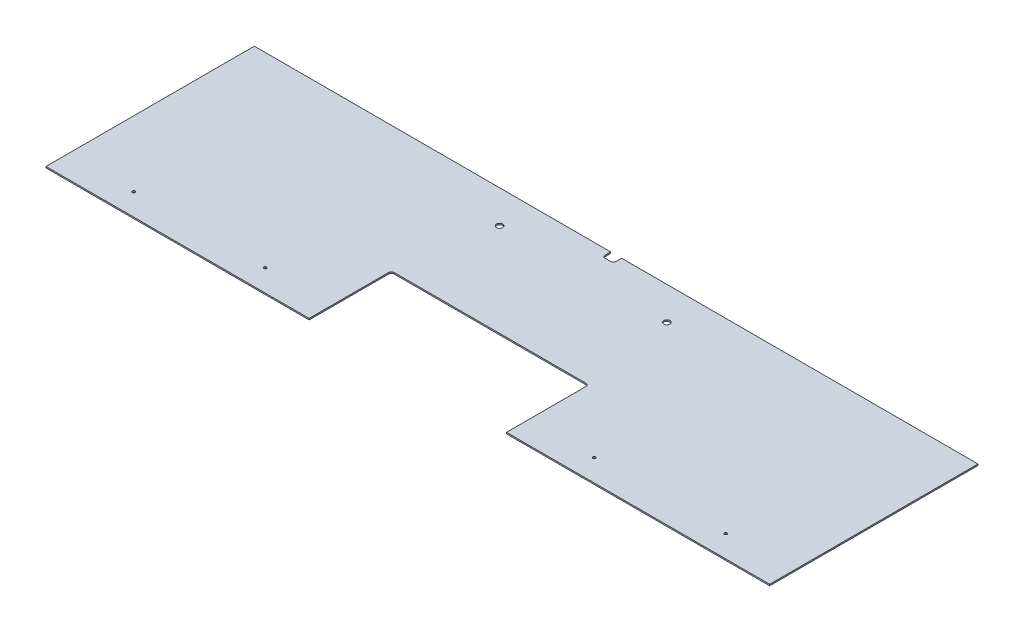
ISO-10303-21;
HEADER;
FILE_DESCRIPTION(('STEP AP214'),'2;1');
FILE_NAME('part.step','',(''),(''),'','','');
FILE_SCHEMA(('AUTOMOTIVE_DESIGN { 1 0 10303 214 1 1 1 1 }'));
ENDSEC;
DATA;
#1=APPLICATION_CONTEXT('core data for automotive mechanical design processes');
#2=APPLICATION_PROTOCOL_DEFINITION('international standard','automotive_design',2000,#1);
#3=PRODUCT_CONTEXT('',#1,'mechanical');
#4=PRODUCT('Part','Part','',(#3));
#5=PRODUCT_RELATED_PRODUCT_CATEGORY('part','',(#4));
#6=PRODUCT_DEFINITION_FORMATION('','',#4);
#7=PRODUCT_DEFINITION_CONTEXT('part definition',#1,'design');
#8=PRODUCT_DEFINITION('design','',#6,#7);
#9=PRODUCT_DEFINITION_SHAPE('','',#8);
#10=(LENGTH_UNIT() NAMED_UNIT(*) SI_UNIT(.MILLI.,.METRE.));
#11=(NAMED_UNIT(*) PLANE_ANGLE_UNIT() SI_UNIT($,.RADIAN.));
#12=(NAMED_UNIT(*) SI_UNIT($,.STERADIAN.) SOLID_ANGLE_UNIT());
#13=UNCERTAINTY_MEASURE_WITH_UNIT(LENGTH_MEASURE(1.E-05),#10,'distance_accuracy_value','');
#14=(GEOMETRIC_REPRESENTATION_CONTEXT(3) GLOBAL_UNCERTAINTY_ASSIGNED_CONTEXT((#13)) GLOBAL_UNIT_ASSIGNED_CONTEXT((#10,
#11,#12)) REPRESENTATION_CONTEXT('',''));
#15=CARTESIAN_POINT('',(0.,0.,0.));
#16=DIRECTION('',(0.,0.,1.));
#17=DIRECTION('',(1.,0.,0.));
#18=AXIS2_PLACEMENT_3D('',#15,#16,#17);
#19=CARTESIAN_POINT('',(2327.96027965546,0.,241.3));
#20=DIRECTION('',(0.,-1.,0.));
#21=DIRECTION('',(0.,0.,-1.));
#22=AXIS2_PLACEMENT_3D('',#19,#20,#21);
#23=PLANE('',#22);
#24=CARTESIAN_POINT('',(2334.31027965546,0.,12.7));
#25=DIRECTION('',(0.,1.,0.));
#26=DIRECTION('',(0.,0.,1.));
#27=AXIS2_PLACEMENT_3D('',#24,#25,#26);
#28=CIRCLE('',#27,6.35);
#29=CARTESIAN_POINT('',(2340.66027965545,0.,12.7));
#30=VERTEX_POINT('',#29);
#31=CARTESIAN_POINT('',(2334.31027965546,0.,19.05));
#32=VERTEX_POINT('',#31);
#33=EDGE_CURVE('E152',#30,#32,#28,.F.);
#34=ORIENTED_EDGE('',*,*,#33,.T.);
#35=DIRECTION('',(-1.,0.,0.));
#36=VECTOR('',#35,1.);
#37=CARTESIAN_POINT('',(2327.96027965546,0.,19.05));
#38=LINE('',#37,#36);
#39=CARTESIAN_POINT('',(2321.61027965545,0.,19.05));
#40=VERTEX_POINT('',#39);
#41=EDGE_CURVE('E155',#40,#32,#38,.F.);
#42=ORIENTED_EDGE('',*,*,#41,.F.);
#43=CARTESIAN_POINT('',(2321.61027965545,0.,12.7));
#44=DIRECTION('',(0.,1.,0.));
#45=DIRECTION('',(0.,0.,1.));
#46=AXIS2_PLACEMENT_3D('',#43,#44,#45);
#47=CIRCLE('',#46,6.35);
#48=CARTESIAN_POINT('',(2315.26027965546,0.,12.7));
#49=VERTEX_POINT('',#48);
#50=EDGE_CURVE('E161',#40,#49,#47,.F.);
#51=ORIENTED_EDGE('',*,*,#50,.T.);
#52=DIRECTION('',(0.,0.,-1.));
#53=VECTOR('',#52,1.);
#54=CARTESIAN_POINT('',(2315.26027965546,0.,9.525));
#55=LINE('',#54,#53);
#56=CARTESIAN_POINT('',(2315.26027965546,0.,0.));
#57=VERTEX_POINT('',#56);
#58=EDGE_CURVE('E165',#57,#49,#55,.F.);
#59=ORIENTED_EDGE('',*,*,#58,.F.);
#60=DIRECTION('',(1.,0.,0.));
#61=VECTOR('',#60,1.);
#62=CARTESIAN_POINT('',(1902.51027965545,0.,0.));
#63=LINE('',#62,#61);
#64=CARTESIAN_POINT('',(1489.76027965546,0.,0.));
#65=VERTEX_POINT('',#64);
#66=EDGE_CURVE('E178',#57,#65,#63,.F.);
#67=ORIENTED_EDGE('',*,*,#66,.T.);
#68=DIRECTION('',(0.,0.,-1.));
#69=VECTOR('',#68,1.);
#70=CARTESIAN_POINT('',(1489.76027965546,0.,241.3));
#71=LINE('',#70,#69);
#72=CARTESIAN_POINT('',(1489.76027965546,0.,482.6));
#73=VERTEX_POINT('',#72);
#74=EDGE_CURVE('E179',#65,#73,#71,.F.);
#75=ORIENTED_EDGE('',*,*,#74,.T.);
#76=DIRECTION('',(1.,0.,0.));
#77=VECTOR('',#76,1.);
#78=CARTESIAN_POINT('',(1794.56027965545,0.,482.6));
#79=LINE('',#78,#77);
#80=CARTESIAN_POINT('',(2099.36027965545,0.,482.6));
#81=VERTEX_POINT('',#80);
#82=EDGE_CURVE('E200',#81,#73,#79,.F.);
#83=ORIENTED_EDGE('',*,*,#82,.F.);
#84=DIRECTION('',(0.,0.,1.));
#85=VECTOR('',#84,1.);
#86=CARTESIAN_POINT('',(2099.36027965545,0.,387.35));
#87=LINE('',#86,#85);
#88=CARTESIAN_POINT('',(2099.36027965545,0.,298.45));
#89=VERTEX_POINT('',#88);
#90=EDGE_CURVE('E205',#81,#89,#87,.F.);
#91=ORIENTED_EDGE('',*,*,#90,.T.);
#92=CARTESIAN_POINT('',(2105.71027965545,0.,298.45));
#93=DIRECTION('',(0.,1.,0.));
#94=DIRECTION('',(0.,0.,1.));
#95=AXIS2_PLACEMENT_3D('',#92,#93,#94);
#96=CIRCLE('',#95,6.35);
#97=CARTESIAN_POINT('',(2105.71027965545,0.,292.1));
#98=VERTEX_POINT('',#97);
#99=EDGE_CURVE('E208',#89,#98,#96,.F.);
#100=ORIENTED_EDGE('',*,*,#99,.T.);
#101=DIRECTION('',(-1.,0.,0.));
#102=VECTOR('',#101,1.);
#103=CARTESIAN_POINT('',(2327.96027965546,0.,292.1));
#104=LINE('',#103,#102);
#105=CARTESIAN_POINT('',(2550.21027965546,0.,292.1));
#106=VERTEX_POINT('',#105);
#107=EDGE_CURVE('E86',#98,#106,#104,.F.);
#108=ORIENTED_EDGE('',*,*,#107,.T.);
#109=CARTESIAN_POINT('',(2550.21027965546,0.,298.45));
#110=DIRECTION('',(0.,-1.,0.));
#111=DIRECTION('',(0.,0.,-1.));
#112=AXIS2_PLACEMENT_3D('',#109,#110,#111);
#113=CIRCLE('',#112,6.35);
#114=CARTESIAN_POINT('',(2556.56027965545,0.,298.45));
#115=VERTEX_POINT('',#114);
#116=EDGE_CURVE('E90',#106,#115,#113,.T.);
#117=ORIENTED_EDGE('',*,*,#116,.T.);
#118=DIRECTION('',(0.,0.,1.));
#119=VECTOR('',#118,1.);
#120=CARTESIAN_POINT('',(2556.56027965545,0.,387.35));
#121=LINE('',#120,#119);
#122=CARTESIAN_POINT('',(2556.56027965545,0.,482.6));
#123=VERTEX_POINT('',#122);
#124=EDGE_CURVE('E95',#123,#115,#121,.F.);
#125=ORIENTED_EDGE('',*,*,#124,.F.);
#126=DIRECTION('',(-1.,0.,0.));
#127=VECTOR('',#126,1.);
#128=CARTESIAN_POINT('',(2861.36027965546,0.,482.6));
#129=LINE('',#128,#127);
#130=CARTESIAN_POINT('',(3166.16027965546,0.,482.6));
#131=VERTEX_POINT('',#130);
#132=EDGE_CURVE('E226',#123,#131,#129,.F.);
#133=ORIENTED_EDGE('',*,*,#132,.T.);
#134=DIRECTION('',(0.,0.,1.));
#135=VECTOR('',#134,1.);
#136=CARTESIAN_POINT('',(3166.16027965546,0.,241.3));
#137=LINE('',#136,#135);
#138=CARTESIAN_POINT('',(3166.16027965546,0.,0.));
#139=VERTEX_POINT('',#138);
#140=EDGE_CURVE('E227',#131,#139,#137,.F.);
#141=ORIENTED_EDGE('',*,*,#140,.T.);
#142=DIRECTION('',(1.,0.,0.));
#143=VECTOR('',#142,1.);
#144=CARTESIAN_POINT('',(2753.41027965545,0.,0.));
#145=LINE('',#144,#143);
#146=CARTESIAN_POINT('',(2340.66027965545,0.,0.));
#147=VERTEX_POINT('',#146);
#148=EDGE_CURVE('E124',#139,#147,#145,.F.);
#149=ORIENTED_EDGE('',*,*,#148,.T.);
#150=DIRECTION('',(0.,0.,1.));
#151=VECTOR('',#150,1.);
#152=CARTESIAN_POINT('',(2340.66027965545,0.,9.525));
#153=LINE('',#152,#151);
#154=EDGE_CURVE('E121',#30,#147,#153,.F.);
#155=ORIENTED_EDGE('',*,*,#154,.F.);
#156=EDGE_LOOP('',(#34,#42,#51,#59,#67,#75,#83,#91,#100,#108,#117,#125,#133,#141,#149,#155));
#157=FACE_BOUND('',#156,.T.);
#158=CARTESIAN_POINT('',(2134.28527965546,0.,76.2));
#159=DIRECTION('',(0.,-1.,0.));
#160=DIRECTION('',(0.,0.,-1.));
#161=AXIS2_PLACEMENT_3D('',#158,#159,#160);
#162=CIRCLE('',#161,7.14375);
#163=CARTESIAN_POINT('',(2134.28527965546,0.,69.05625));
#164=VERTEX_POINT('',#163);
#165=EDGE_CURVE('E242',#164,#164,#162,.T.);
#166=ORIENTED_EDGE('',*,*,#165,.T.);
#167=EDGE_LOOP('',(#166));
#168=FACE_BOUND('',#167,.T.);
#169=CARTESIAN_POINT('',(2521.63527965546,0.,76.2));
#170=DIRECTION('',(0.,-1.,0.));
#171=DIRECTION('',(0.,0.,-1.));
#172=AXIS2_PLACEMENT_3D('',#169,#170,#171);
#173=CIRCLE('',#172,7.14375);
#174=CARTESIAN_POINT('',(2521.63527965546,0.,69.05625));
#175=VERTEX_POINT('',#174);
#176=EDGE_CURVE('E307',#175,#175,#173,.T.);
#177=ORIENTED_EDGE('',*,*,#176,.T.);
#178=EDGE_LOOP('',(#177));
#179=FACE_BOUND('',#178,.T.);
#180=CARTESIAN_POINT('',(1642.16027965546,0.,431.8));
#181=DIRECTION('',(0.,1.,0.));
#182=DIRECTION('',(0.,0.,1.));
#183=AXIS2_PLACEMENT_3D('',#180,#181,#182);
#184=CIRCLE('',#183,3.175);
#185=CARTESIAN_POINT('',(1642.16027965546,0.,434.975));
#186=VERTEX_POINT('',#185);
#187=EDGE_CURVE('E310',#186,#186,#184,.F.);
#188=ORIENTED_EDGE('',*,*,#187,.T.);
#189=EDGE_LOOP('',(#188));
#190=FACE_BOUND('',#189,.T.);
#191=CARTESIAN_POINT('',(1946.96027965546,0.,431.8));
#192=DIRECTION('',(0.,1.,0.));
#193=DIRECTION('',(0.,0.,1.));
#194=AXIS2_PLACEMENT_3D('',#191,#192,#193);
#195=CIRCLE('',#194,3.175);
#196=CARTESIAN_POINT('',(1946.96027965546,0.,434.975));
#197=VERTEX_POINT('',#196);
#198=EDGE_CURVE('E313',#197,#197,#195,.F.);
#199=ORIENTED_EDGE('',*,*,#198,.T.);
#200=EDGE_LOOP('',(#199));
#201=FACE_BOUND('',#200,.T.);
#202=CARTESIAN_POINT('',(2708.96027965546,0.,431.8));
#203=DIRECTION('',(0.,1.,0.));
#204=DIRECTION('',(0.,0.,1.));
#205=AXIS2_PLACEMENT_3D('',#202,#203,#204);
#206=CIRCLE('',#205,3.175);
#207=CARTESIAN_POINT('',(2708.96027965546,0.,434.975));
#208=VERTEX_POINT('',#207);
#209=EDGE_CURVE('E315',#208,#208,#206,.F.);
#210=ORIENTED_EDGE('',*,*,#209,.T.);
#211=EDGE_LOOP('',(#210));
#212=FACE_BOUND('',#211,.T.);
#213=CARTESIAN_POINT('',(3013.76027965546,0.,431.8));
#214=DIRECTION('',(0.,1.,0.));
#215=DIRECTION('',(0.,0.,1.));
#216=AXIS2_PLACEMENT_3D('',#213,#214,#215);
#217=CIRCLE('',#216,3.175);
#218=CARTESIAN_POINT('',(3013.76027965546,0.,434.975));
#219=VERTEX_POINT('',#218);
#220=EDGE_CURVE('E17',#219,#219,#217,.F.);
#221=ORIENTED_EDGE('',*,*,#220,.T.);
#222=EDGE_LOOP('',(#221));
#223=FACE_BOUND('',#222,.T.);
#224=ADVANCED_FACE('F14',(#157,#168,#179,#190,#201,#212,#223),#23,.F.);
#225=CARTESIAN_POINT('',(3013.76027965546,1742.26440662134,431.8));
#226=DIRECTION('',(0.,1.,0.));
#227=DIRECTION('',(0.,0.,1.));
#228=AXIS2_PLACEMENT_3D('',#225,#226,#227);
#229=CYLINDRICAL_SURFACE('',#228,3.175);
#230=ORIENTED_EDGE('',*,*,#220,.F.);
#231=EDGE_LOOP('',(#230));
#232=FACE_BOUND('',#231,.T.);
#233=CARTESIAN_POINT('',(3013.76027965546,-3.17499999999993,431.8));
#234=DIRECTION('',(0.,1.,0.));
#235=DIRECTION('',(0.,0.,1.));
#236=AXIS2_PLACEMENT_3D('',#233,#234,#235);
#237=CIRCLE('',#236,3.175);
#238=CARTESIAN_POINT('',(3013.76027965546,-3.17499999999993,434.975));
#239=VERTEX_POINT('',#238);
#240=EDGE_CURVE('E151',#239,#239,#237,.T.);
#241=ORIENTED_EDGE('',*,*,#240,.F.);
#242=EDGE_LOOP('',(#241));
#243=FACE_BOUND('',#242,.T.);
#244=ADVANCED_FACE('F323',(#232,#243),#229,.F.);
#245=CARTESIAN_POINT('',(2708.96027965546,1742.26440662134,431.8));
#246=DIRECTION('',(0.,1.,0.));
#247=DIRECTION('',(0.,0.,1.));
#248=AXIS2_PLACEMENT_3D('',#245,#246,#247);
#249=CYLINDRICAL_SURFACE('',#248,3.175);
#250=ORIENTED_EDGE('',*,*,#209,.F.);
#251=EDGE_LOOP('',(#250));
#252=FACE_BOUND('',#251,.T.);
#253=CARTESIAN_POINT('',(2708.96027965546,-3.17499999999993,431.8));
#254=DIRECTION('',(0.,1.,0.));
#255=DIRECTION('',(0.,0.,1.));
#256=AXIS2_PLACEMENT_3D('',#253,#254,#255);
#257=CIRCLE('',#256,3.175);
#258=CARTESIAN_POINT('',(2708.96027965546,-3.17499999999993,434.975));
#259=VERTEX_POINT('',#258);
#260=EDGE_CURVE('E296',#259,#259,#257,.T.);
#261=ORIENTED_EDGE('',*,*,#260,.F.);
#262=EDGE_LOOP('',(#261));
#263=FACE_BOUND('',#262,.T.);
#264=ADVANCED_FACE('F326',(#252,#263),#249,.F.);
#265=CARTESIAN_POINT('',(1946.96027965546,1742.26440662134,431.8));
#266=DIRECTION('',(0.,1.,0.));
#267=DIRECTION('',(0.,0.,1.));
#268=AXIS2_PLACEMENT_3D('',#265,#266,#267);
#269=CYLINDRICAL_SURFACE('',#268,3.175);
#270=ORIENTED_EDGE('',*,*,#198,.F.);
#271=EDGE_LOOP('',(#270));
#272=FACE_BOUND('',#271,.T.);
#273=CARTESIAN_POINT('',(1946.96027965546,-3.17499999999993,431.8));
#274=DIRECTION('',(0.,1.,0.));
#275=DIRECTION('',(0.,0.,1.));
#276=AXIS2_PLACEMENT_3D('',#273,#274,#275);
#277=CIRCLE('',#276,3.175);
#278=CARTESIAN_POINT('',(1946.96027965546,-3.17499999999993,434.975));
#279=VERTEX_POINT('',#278);
#280=EDGE_CURVE('E293',#279,#279,#277,.T.);
#281=ORIENTED_EDGE('',*,*,#280,.F.);
#282=EDGE_LOOP('',(#281));
#283=FACE_BOUND('',#282,.T.);
#284=ADVANCED_FACE('F405',(#272,#283),#269,.F.);
#285=CARTESIAN_POINT('',(1642.16027965546,1742.26440662134,431.8));
#286=DIRECTION('',(0.,1.,0.));
#287=DIRECTION('',(0.,0.,1.));
#288=AXIS2_PLACEMENT_3D('',#285,#286,#287);
#289=CYLINDRICAL_SURFACE('',#288,3.175);
#290=ORIENTED_EDGE('',*,*,#187,.F.);
#291=EDGE_LOOP('',(#290));
#292=FACE_BOUND('',#291,.T.);
#293=CARTESIAN_POINT('',(1642.16027965546,-3.17499999999993,431.8));
#294=DIRECTION('',(0.,1.,0.));
#295=DIRECTION('',(0.,0.,1.));
#296=AXIS2_PLACEMENT_3D('',#293,#294,#295);
#297=CIRCLE('',#296,3.175);
#298=CARTESIAN_POINT('',(1642.16027965546,-3.17499999999993,434.975));
#299=VERTEX_POINT('',#298);
#300=EDGE_CURVE('E290',#299,#299,#297,.T.);
#301=ORIENTED_EDGE('',*,*,#300,.F.);
#302=EDGE_LOOP('',(#301));
#303=FACE_BOUND('',#302,.T.);
#304=ADVANCED_FACE('F401',(#292,#303),#289,.F.);
#305=CARTESIAN_POINT('',(2521.63527965546,-1746.63173941221,76.2));
#306=DIRECTION('',(0.,-1.,0.));
#307=DIRECTION('',(0.,0.,-1.));
#308=AXIS2_PLACEMENT_3D('',#305,#306,#307);
#309=CYLINDRICAL_SURFACE('',#308,7.14375);
#310=ORIENTED_EDGE('',*,*,#176,.F.);
#311=EDGE_LOOP('',(#310));
#312=FACE_BOUND('',#311,.T.);
#313=CARTESIAN_POINT('',(2521.63527965546,-3.17499999999993,76.2));
#314=DIRECTION('',(0.,-1.,0.));
#315=DIRECTION('',(0.,0.,-1.));
#316=AXIS2_PLACEMENT_3D('',#313,#314,#315);
#317=CIRCLE('',#316,7.14375);
#318=CARTESIAN_POINT('',(2521.63527965546,-3.17499999999993,69.05625));
#319=VERTEX_POINT('',#318);
#320=EDGE_CURVE('E142',#319,#319,#317,.F.);
#321=ORIENTED_EDGE('',*,*,#320,.F.);
#322=EDGE_LOOP('',(#321));
#323=FACE_BOUND('',#322,.T.);
#324=ADVANCED_FACE('F397',(#312,#323),#309,.F.);
#325=CARTESIAN_POINT('',(2134.28527965546,-1746.63173941221,76.2));
#326=DIRECTION('',(0.,-1.,0.));
#327=DIRECTION('',(0.,0.,-1.));
#328=AXIS2_PLACEMENT_3D('',#325,#326,#327);
#329=CYLINDRICAL_SURFACE('',#328,7.14375);
#330=ORIENTED_EDGE('',*,*,#165,.F.);
#331=EDGE_LOOP('',(#330));
#332=FACE_BOUND('',#331,.T.);
#333=CARTESIAN_POINT('',(2134.28527965546,-3.17499999999993,76.2));
#334=DIRECTION('',(0.,-1.,0.));
#335=DIRECTION('',(0.,0.,-1.));
#336=AXIS2_PLACEMENT_3D('',#333,#334,#335);
#337=CIRCLE('',#336,7.14375);
#338=CARTESIAN_POINT('',(2134.28527965546,-3.17499999999993,69.05625));
#339=VERTEX_POINT('',#338);
#340=EDGE_CURVE('E139',#339,#339,#337,.F.);
#341=ORIENTED_EDGE('',*,*,#340,.F.);
#342=EDGE_LOOP('',(#341));
#343=FACE_BOUND('',#342,.T.);
#344=ADVANCED_FACE('F394',(#332,#343),#329,.F.);
#345=CARTESIAN_POINT('',(2340.66027965545,-3.175,9.525));
#346=DIRECTION('',(-1.,0.,0.));
#347=DIRECTION('',(0.,0.,1.));
#348=AXIS2_PLACEMENT_3D('',#345,#346,#347);
#349=PLANE('',#348);
#350=ORIENTED_EDGE('',*,*,#154,.T.);
#351=DIRECTION('',(0.,1.,0.));
#352=VECTOR('',#351,1.);
#353=CARTESIAN_POINT('',(2340.66027965545,-3.175,0.));
#354=LINE('',#353,#352);
#355=CARTESIAN_POINT('',(2340.66027965545,-3.175,0.));
#356=VERTEX_POINT('',#355);
#357=EDGE_CURVE('E114',#147,#356,#354,.F.);
#358=ORIENTED_EDGE('',*,*,#357,.T.);
#359=DIRECTION('',(0.,0.,-1.));
#360=VECTOR('',#359,1.);
#361=CARTESIAN_POINT('',(2340.66027965545,-3.175,241.3));
#362=LINE('',#361,#360);
#363=CARTESIAN_POINT('',(2340.66027965545,-3.175,12.7));
#364=VERTEX_POINT('',#363);
#365=EDGE_CURVE('E119',#364,#356,#362,.T.);
#366=ORIENTED_EDGE('',*,*,#365,.F.);
#367=DIRECTION('',(0.,1.,0.));
#368=VECTOR('',#367,1.);
#369=CARTESIAN_POINT('',(2340.66027965546,-3.175,12.7));
#370=LINE('',#369,#368);
#371=EDGE_CURVE('E153',#364,#30,#370,.T.);
#372=ORIENTED_EDGE('',*,*,#371,.T.);
#373=EDGE_LOOP('',(#350,#358,#366,#372));
#374=FACE_BOUND('',#373,.T.);
#375=ADVANCED_FACE('F116',(#374),#349,.T.);
#376=CARTESIAN_POINT('',(2753.41027965545,-3.175,0.));
#377=DIRECTION('',(0.,0.,1.));
#378=DIRECTION('',(1.,0.,0.));
#379=AXIS2_PLACEMENT_3D('',#376,#377,#378);
#380=PLANE('',#379);
#381=DIRECTION('',(0.,1.,0.));
#382=VECTOR('',#381,1.);
#383=CARTESIAN_POINT('',(3166.16027965546,-3.175,0.));
#384=LINE('',#383,#382);
#385=CARTESIAN_POINT('',(3166.16027965546,-3.175,0.));
#386=VERTEX_POINT('',#385);
#387=EDGE_CURVE('E130',#139,#386,#384,.F.);
#388=ORIENTED_EDGE('',*,*,#387,.T.);
#389=DIRECTION('',(1.,0.,0.));
#390=VECTOR('',#389,1.);
#391=CARTESIAN_POINT('',(2327.96027965546,-3.175,0.));
#392=LINE('',#391,#390);
#393=EDGE_CURVE('E127',#356,#386,#392,.T.);
#394=ORIENTED_EDGE('',*,*,#393,.F.);
#395=ORIENTED_EDGE('',*,*,#357,.F.);
#396=ORIENTED_EDGE('',*,*,#148,.F.);
#397=EDGE_LOOP('',(#388,#394,#395,#396));
#398=FACE_BOUND('',#397,.T.);
#399=ADVANCED_FACE('F128',(#398),#380,.F.);
#400=CARTESIAN_POINT('',(3166.16027965546,-3.175,241.3));
#401=DIRECTION('',(-1.,0.,0.));
#402=DIRECTION('',(0.,0.,1.));
#403=AXIS2_PLACEMENT_3D('',#400,#401,#402);
#404=PLANE('',#403);
#405=DIRECTION('',(0.,1.,0.));
#406=VECTOR('',#405,1.);
#407=CARTESIAN_POINT('',(3166.16027965546,-3.175,482.6));
#408=LINE('',#407,#406);
#409=CARTESIAN_POINT('',(3166.16027965546,-3.175,482.6));
#410=VERTEX_POINT('',#409);
#411=EDGE_CURVE('E224',#131,#410,#408,.F.);
#412=ORIENTED_EDGE('',*,*,#411,.T.);
#413=DIRECTION('',(0.,0.,-1.));
#414=VECTOR('',#413,1.);
#415=CARTESIAN_POINT('',(3166.16027965546,-3.175,241.3));
#416=LINE('',#415,#414);
#417=EDGE_CURVE('E134',#386,#410,#416,.F.);
#418=ORIENTED_EDGE('',*,*,#417,.F.);
#419=ORIENTED_EDGE('',*,*,#387,.F.);
#420=ORIENTED_EDGE('',*,*,#140,.F.);
#421=EDGE_LOOP('',(#412,#418,#419,#420));
#422=FACE_BOUND('',#421,.T.);
#423=ADVANCED_FACE('F385',(#422),#404,.F.);
#424=CARTESIAN_POINT('',(2861.36027965546,-3.175,482.6));
#425=DIRECTION('',(0.,0.,-1.));
#426=DIRECTION('',(-1.,0.,0.));
#427=AXIS2_PLACEMENT_3D('',#424,#425,#426);
#428=PLANE('',#427);
#429=DIRECTION('',(0.,1.,0.));
#430=VECTOR('',#429,1.);
#431=CARTESIAN_POINT('',(2556.56027965545,-3.175,482.6));
#432=LINE('',#431,#430);
#433=CARTESIAN_POINT('',(2556.56027965545,-3.175,482.6));
#434=VERTEX_POINT('',#433);
#435=EDGE_CURVE('E213',#434,#123,#432,.T.);
#436=ORIENTED_EDGE('',*,*,#435,.F.);
#437=DIRECTION('',(1.,0.,0.));
#438=VECTOR('',#437,1.);
#439=CARTESIAN_POINT('',(2327.96027965546,-3.175,482.6));
#440=LINE('',#439,#438);
#441=EDGE_CURVE('E218',#410,#434,#440,.F.);
#442=ORIENTED_EDGE('',*,*,#441,.F.);
#443=ORIENTED_EDGE('',*,*,#411,.F.);
#444=ORIENTED_EDGE('',*,*,#132,.F.);
#445=EDGE_LOOP('',(#436,#442,#443,#444));
#446=FACE_BOUND('',#445,.T.);
#447=ADVANCED_FACE('F381',(#446),#428,.F.);
#448=CARTESIAN_POINT('',(2556.56027965545,-3.175,387.35));
#449=DIRECTION('',(-1.,0.,0.));
#450=DIRECTION('',(0.,0.,1.));
#451=AXIS2_PLACEMENT_3D('',#448,#449,#450);
#452=PLANE('',#451);
#453=DIRECTION('',(0.,0.,-1.));
#454=VECTOR('',#453,1.);
#455=CARTESIAN_POINT('',(2556.56027965545,-3.175,241.3));
#456=LINE('',#455,#454);
#457=CARTESIAN_POINT('',(2556.56027965545,-3.175,298.45));
#458=VERTEX_POINT('',#457);
#459=EDGE_CURVE('E221',#434,#458,#456,.T.);
#460=ORIENTED_EDGE('',*,*,#459,.F.);
#461=ORIENTED_EDGE('',*,*,#435,.T.);
#462=ORIENTED_EDGE('',*,*,#124,.T.);
#463=DIRECTION('',(0.,-1.,0.));
#464=VECTOR('',#463,1.);
#465=CARTESIAN_POINT('',(2556.56027965546,-3.175,298.45));
#466=LINE('',#465,#464);
#467=EDGE_CURVE('E211',#115,#458,#466,.T.);
#468=ORIENTED_EDGE('',*,*,#467,.T.);
#469=EDGE_LOOP('',(#460,#461,#462,#468));
#470=FACE_BOUND('',#469,.T.);
#471=ADVANCED_FACE('F377',(#470),#452,.T.);
#472=CARTESIAN_POINT('',(2550.21027965546,-3.175,298.45));
#473=DIRECTION('',(0.,-1.,0.));
#474=DIRECTION('',(0.,0.,-1.));
#475=AXIS2_PLACEMENT_3D('',#472,#473,#474);
#476=CYLINDRICAL_SURFACE('',#475,6.35);
#477=ORIENTED_EDGE('',*,*,#467,.F.);
#478=ORIENTED_EDGE('',*,*,#116,.F.);
#479=DIRECTION('',(0.,1.,0.));
#480=VECTOR('',#479,1.);
#481=CARTESIAN_POINT('',(2550.21027965546,-3.175,292.1));
#482=LINE('',#481,#480);
#483=CARTESIAN_POINT('',(2550.21027965546,-3.175,292.1));
#484=VERTEX_POINT('',#483);
#485=EDGE_CURVE('E209',#106,#484,#482,.F.);
#486=ORIENTED_EDGE('',*,*,#485,.T.);
#487=CARTESIAN_POINT('',(2550.21027965546,-3.175,298.45));
#488=DIRECTION('',(0.,-1.,0.));
#489=DIRECTION('',(0.,0.,-1.));
#490=AXIS2_PLACEMENT_3D('',#487,#488,#489);
#491=CIRCLE('',#490,6.35);
#492=EDGE_CURVE('E285',#458,#484,#491,.F.);
#493=ORIENTED_EDGE('',*,*,#492,.F.);
#494=EDGE_LOOP('',(#477,#478,#486,#493));
#495=FACE_BOUND('',#494,.T.);
#496=ADVANCED_FACE('F373',(#495),#476,.F.);
#497=CARTESIAN_POINT('',(2327.96027965546,-3.175,292.1));
#498=DIRECTION('',(0.,0.,-1.));
#499=DIRECTION('',(-1.,0.,0.));
#500=AXIS2_PLACEMENT_3D('',#497,#498,#499);
#501=PLANE('',#500);
#502=ORIENTED_EDGE('',*,*,#485,.F.);
#503=ORIENTED_EDGE('',*,*,#107,.F.);
#504=DIRECTION('',(0.,1.,0.));
#505=VECTOR('',#504,1.);
#506=CARTESIAN_POINT('',(2105.71027965545,-3.175,292.1));
#507=LINE('',#506,#505);
#508=CARTESIAN_POINT('',(2105.71027965545,-3.175,292.1));
#509=VERTEX_POINT('',#508);
#510=EDGE_CURVE('E206',#98,#509,#507,.F.);
#511=ORIENTED_EDGE('',*,*,#510,.T.);
#512=DIRECTION('',(1.,0.,0.));
#513=VECTOR('',#512,1.);
#514=CARTESIAN_POINT('',(2327.96027965546,-3.175,292.1));
#515=LINE('',#514,#513);
#516=EDGE_CURVE('E284',#484,#509,#515,.F.);
#517=ORIENTED_EDGE('',*,*,#516,.F.);
#518=EDGE_LOOP('',(#502,#503,#511,#517));
#519=FACE_BOUND('',#518,.T.);
#520=ADVANCED_FACE('F369',(#519),#501,.F.);
#521=CARTESIAN_POINT('',(2105.71027965545,-3.175,298.45));
#522=DIRECTION('',(0.,1.,0.));
#523=DIRECTION('',(0.,0.,1.));
#524=AXIS2_PLACEMENT_3D('',#521,#522,#523);
#525=CYLINDRICAL_SURFACE('',#524,6.35);
#526=ORIENTED_EDGE('',*,*,#510,.F.);
#527=ORIENTED_EDGE('',*,*,#99,.F.);
#528=DIRECTION('',(0.,1.,0.));
#529=VECTOR('',#528,1.);
#530=CARTESIAN_POINT('',(2099.36027965545,-3.175,298.45));
#531=LINE('',#530,#529);
#532=CARTESIAN_POINT('',(2099.36027965545,-3.175,298.45));
#533=VERTEX_POINT('',#532);
#534=EDGE_CURVE('E203',#89,#533,#531,.F.);
#535=ORIENTED_EDGE('',*,*,#534,.T.);
#536=CARTESIAN_POINT('',(2105.71027965545,-3.175,298.45));
#537=DIRECTION('',(0.,1.,0.));
#538=DIRECTION('',(0.,0.,1.));
#539=AXIS2_PLACEMENT_3D('',#536,#537,#538);
#540=CIRCLE('',#539,6.35);
#541=EDGE_CURVE('E281',#509,#533,#540,.T.);
#542=ORIENTED_EDGE('',*,*,#541,.F.);
#543=EDGE_LOOP('',(#526,#527,#535,#542));
#544=FACE_BOUND('',#543,.T.);
#545=ADVANCED_FACE('F365',(#544),#525,.F.);
#546=CARTESIAN_POINT('',(2099.36027965545,-3.175,387.35));
#547=DIRECTION('',(-1.,0.,0.));
#548=DIRECTION('',(0.,0.,1.));
#549=AXIS2_PLACEMENT_3D('',#546,#547,#548);
#550=PLANE('',#549);
#551=ORIENTED_EDGE('',*,*,#534,.F.);
#552=ORIENTED_EDGE('',*,*,#90,.F.);
#553=DIRECTION('',(0.,1.,0.));
#554=VECTOR('',#553,1.);
#555=CARTESIAN_POINT('',(2099.36027965545,-3.175,482.6));
#556=LINE('',#555,#554);
#557=CARTESIAN_POINT('',(2099.36027965545,-3.175,482.6));
#558=VERTEX_POINT('',#557);
#559=EDGE_CURVE('E190',#558,#81,#556,.T.);
#560=ORIENTED_EDGE('',*,*,#559,.F.);
#561=DIRECTION('',(0.,0.,-1.));
#562=VECTOR('',#561,1.);
#563=CARTESIAN_POINT('',(2099.36027965545,-3.175,241.3));
#564=LINE('',#563,#562);
#565=EDGE_CURVE('E195',#533,#558,#564,.F.);
#566=ORIENTED_EDGE('',*,*,#565,.F.);
#567=EDGE_LOOP('',(#551,#552,#560,#566));
#568=FACE_BOUND('',#567,.T.);
#569=ADVANCED_FACE('F361',(#568),#550,.F.);
#570=CARTESIAN_POINT('',(1794.56027965545,-3.175,482.6));
#571=DIRECTION('',(0.,0.,1.));
#572=DIRECTION('',(1.,0.,0.));
#573=AXIS2_PLACEMENT_3D('',#570,#571,#572);
#574=PLANE('',#573);
#575=DIRECTION('',(1.,0.,0.));
#576=VECTOR('',#575,1.);
#577=CARTESIAN_POINT('',(2327.96027965546,-3.175,482.6));
#578=LINE('',#577,#576);
#579=CARTESIAN_POINT('',(1489.76027965546,-3.175,482.6));
#580=VERTEX_POINT('',#579);
#581=EDGE_CURVE('E184',#558,#580,#578,.F.);
#582=ORIENTED_EDGE('',*,*,#581,.F.);
#583=ORIENTED_EDGE('',*,*,#559,.T.);
#584=ORIENTED_EDGE('',*,*,#82,.T.);
#585=DIRECTION('',(0.,1.,0.));
#586=VECTOR('',#585,1.);
#587=CARTESIAN_POINT('',(1489.76027965546,-3.175,482.6));
#588=LINE('',#587,#586);
#589=EDGE_CURVE('E187',#73,#580,#588,.F.);
#590=ORIENTED_EDGE('',*,*,#589,.T.);
#591=EDGE_LOOP('',(#582,#583,#584,#590));
#592=FACE_BOUND('',#591,.T.);
#593=ADVANCED_FACE('F357',(#592),#574,.T.);
#594=CARTESIAN_POINT('',(1489.76027965546,-3.175,241.3));
#595=DIRECTION('',(1.,0.,0.));
#596=DIRECTION('',(0.,0.,-1.));
#597=AXIS2_PLACEMENT_3D('',#594,#595,#596);
#598=PLANE('',#597);
#599=DIRECTION('',(0.,1.,0.));
#600=VECTOR('',#599,1.);
#601=CARTESIAN_POINT('',(1489.76027965546,-3.175,0.));
#602=LINE('',#601,#600);
#603=CARTESIAN_POINT('',(1489.76027965546,-3.175,0.));
#604=VERTEX_POINT('',#603);
#605=EDGE_CURVE('E175',#65,#604,#602,.F.);
#606=ORIENTED_EDGE('',*,*,#605,.T.);
#607=DIRECTION('',(0.,0.,-1.));
#608=VECTOR('',#607,1.);
#609=CARTESIAN_POINT('',(1489.76027965546,-3.175,241.3));
#610=LINE('',#609,#608);
#611=EDGE_CURVE('E172',#580,#604,#610,.T.);
#612=ORIENTED_EDGE('',*,*,#611,.F.);
#613=ORIENTED_EDGE('',*,*,#589,.F.);
#614=ORIENTED_EDGE('',*,*,#74,.F.);
#615=EDGE_LOOP('',(#606,#612,#613,#614));
#616=FACE_BOUND('',#615,.T.);
#617=ADVANCED_FACE('F353',(#616),#598,.F.);
#618=CARTESIAN_POINT('',(1902.51027965545,-3.175,0.));
#619=DIRECTION('',(0.,0.,1.));
#620=DIRECTION('',(1.,0.,0.));
#621=AXIS2_PLACEMENT_3D('',#618,#619,#620);
#622=PLANE('',#621);
#623=DIRECTION('',(0.,1.,0.));
#624=VECTOR('',#623,1.);
#625=CARTESIAN_POINT('',(2315.26027965546,-3.175,0.));
#626=LINE('',#625,#624);
#627=CARTESIAN_POINT('',(2315.26027965546,-3.175,0.));
#628=VERTEX_POINT('',#627);
#629=EDGE_CURVE('E162',#628,#57,#626,.T.);
#630=ORIENTED_EDGE('',*,*,#629,.F.);
#631=DIRECTION('',(1.,0.,0.));
#632=VECTOR('',#631,1.);
#633=CARTESIAN_POINT('',(2327.96027965546,-3.175,0.));
#634=LINE('',#633,#632);
#635=EDGE_CURVE('E168',#604,#628,#634,.T.);
#636=ORIENTED_EDGE('',*,*,#635,.F.);
#637=ORIENTED_EDGE('',*,*,#605,.F.);
#638=ORIENTED_EDGE('',*,*,#66,.F.);
#639=EDGE_LOOP('',(#630,#636,#637,#638));
#640=FACE_BOUND('',#639,.T.);
#641=ADVANCED_FACE('F349',(#640),#622,.F.);
#642=CARTESIAN_POINT('',(2315.26027965546,-3.175,9.525));
#643=DIRECTION('',(1.,0.,0.));
#644=DIRECTION('',(0.,0.,-1.));
#645=AXIS2_PLACEMENT_3D('',#642,#643,#644);
#646=PLANE('',#645);
#647=DIRECTION('',(0.,0.,-1.));
#648=VECTOR('',#647,1.);
#649=CARTESIAN_POINT('',(2315.26027965546,-3.175,241.3));
#650=LINE('',#649,#648);
#651=CARTESIAN_POINT('',(2315.26027965546,-3.175,12.7));
#652=VERTEX_POINT('',#651);
#653=EDGE_CURVE('E171',#628,#652,#650,.F.);
#654=ORIENTED_EDGE('',*,*,#653,.F.);
#655=ORIENTED_EDGE('',*,*,#629,.T.);
#656=ORIENTED_EDGE('',*,*,#58,.T.);
#657=DIRECTION('',(0.,1.,0.));
#658=VECTOR('',#657,1.);
#659=CARTESIAN_POINT('',(2315.26027965545,-3.175,12.7));
#660=LINE('',#659,#658);
#661=EDGE_CURVE('E159',#49,#652,#660,.F.);
#662=ORIENTED_EDGE('',*,*,#661,.T.);
#663=EDGE_LOOP('',(#654,#655,#656,#662));
#664=FACE_BOUND('',#663,.T.);
#665=ADVANCED_FACE('F345',(#664),#646,.T.);
#666=CARTESIAN_POINT('',(2321.61027965545,-3.175,12.7));
#667=DIRECTION('',(0.,1.,0.));
#668=DIRECTION('',(0.,0.,1.));
#669=AXIS2_PLACEMENT_3D('',#666,#667,#668);
#670=CYLINDRICAL_SURFACE('',#669,6.35);
#671=ORIENTED_EDGE('',*,*,#661,.F.);
#672=ORIENTED_EDGE('',*,*,#50,.F.);
#673=DIRECTION('',(0.,1.,0.));
#674=VECTOR('',#673,1.);
#675=CARTESIAN_POINT('',(2321.61027965545,-3.175,19.05));
#676=LINE('',#675,#674);
#677=CARTESIAN_POINT('',(2321.61027965545,-3.175,19.05));
#678=VERTEX_POINT('',#677);
#679=EDGE_CURVE('E156',#678,#40,#676,.T.);
#680=ORIENTED_EDGE('',*,*,#679,.F.);
#681=CARTESIAN_POINT('',(2321.61027965545,-3.175,12.7));
#682=DIRECTION('',(0.,1.,0.));
#683=DIRECTION('',(0.,0.,1.));
#684=AXIS2_PLACEMENT_3D('',#681,#682,#683);
#685=CIRCLE('',#684,6.35);
#686=EDGE_CURVE('E278',#652,#678,#685,.T.);
#687=ORIENTED_EDGE('',*,*,#686,.F.);
#688=EDGE_LOOP('',(#671,#672,#680,#687));
#689=FACE_BOUND('',#688,.T.);
#690=ADVANCED_FACE('F342',(#689),#670,.F.);
#691=CARTESIAN_POINT('',(2327.96027965546,-3.175,19.05));
#692=DIRECTION('',(0.,0.,-1.));
#693=DIRECTION('',(-1.,0.,0.));
#694=AXIS2_PLACEMENT_3D('',#691,#692,#693);
#695=PLANE('',#694);
#696=ORIENTED_EDGE('',*,*,#41,.T.);
#697=DIRECTION('',(0.,1.,0.));
#698=VECTOR('',#697,1.);
#699=CARTESIAN_POINT('',(2334.31027965546,-3.175,19.05));
#700=LINE('',#699,#698);
#701=CARTESIAN_POINT('',(2334.31027965546,-3.175,19.05));
#702=VERTEX_POINT('',#701);
#703=EDGE_CURVE('E32',#32,#702,#700,.F.);
#704=ORIENTED_EDGE('',*,*,#703,.T.);
#705=DIRECTION('',(1.,0.,0.));
#706=VECTOR('',#705,1.);
#707=CARTESIAN_POINT('',(2327.96027965546,-3.175,19.05));
#708=LINE('',#707,#706);
#709=EDGE_CURVE('E23',#678,#702,#708,.T.);
#710=ORIENTED_EDGE('',*,*,#709,.F.);
#711=ORIENTED_EDGE('',*,*,#679,.T.);
#712=EDGE_LOOP('',(#696,#704,#710,#711));
#713=FACE_BOUND('',#712,.T.);
#714=ADVANCED_FACE('F336',(#713),#695,.T.);
#715=CARTESIAN_POINT('',(2334.31027965546,-3.175,12.7));
#716=DIRECTION('',(0.,1.,0.));
#717=DIRECTION('',(0.,0.,1.));
#718=AXIS2_PLACEMENT_3D('',#715,#716,#717);
#719=CYLINDRICAL_SURFACE('',#718,6.35);
#720=ORIENTED_EDGE('',*,*,#703,.F.);
#721=ORIENTED_EDGE('',*,*,#33,.F.);
#722=ORIENTED_EDGE('',*,*,#371,.F.);
#723=CARTESIAN_POINT('',(2334.31027965546,-3.175,12.7));
#724=DIRECTION('',(0.,1.,0.));
#725=DIRECTION('',(0.,0.,1.));
#726=AXIS2_PLACEMENT_3D('',#723,#724,#725);
#727=CIRCLE('',#726,6.35);
#728=EDGE_CURVE('E9',#702,#364,#727,.T.);
#729=ORIENTED_EDGE('',*,*,#728,.F.);
#730=EDGE_LOOP('',(#720,#721,#722,#729));
#731=FACE_BOUND('',#730,.T.);
#732=ADVANCED_FACE('F330',(#731),#719,.F.);
#733=CARTESIAN_POINT('',(2327.96027965546,-3.175,241.3));
#734=DIRECTION('',(0.,-1.,0.));
#735=DIRECTION('',(0.,0.,-1.));
#736=AXIS2_PLACEMENT_3D('',#733,#734,#735);
#737=PLANE('',#736);
#738=ORIENTED_EDGE('',*,*,#709,.T.);
#739=ORIENTED_EDGE('',*,*,#728,.T.);
#740=ORIENTED_EDGE('',*,*,#365,.T.);
#741=ORIENTED_EDGE('',*,*,#393,.T.);
#742=ORIENTED_EDGE('',*,*,#417,.T.);
#743=ORIENTED_EDGE('',*,*,#441,.T.);
#744=ORIENTED_EDGE('',*,*,#459,.T.);
#745=ORIENTED_EDGE('',*,*,#492,.T.);
#746=ORIENTED_EDGE('',*,*,#516,.T.);
#747=ORIENTED_EDGE('',*,*,#541,.T.);
#748=ORIENTED_EDGE('',*,*,#565,.T.);
#749=ORIENTED_EDGE('',*,*,#581,.T.);
#750=ORIENTED_EDGE('',*,*,#611,.T.);
#751=ORIENTED_EDGE('',*,*,#635,.T.);
#752=ORIENTED_EDGE('',*,*,#653,.T.);
#753=ORIENTED_EDGE('',*,*,#686,.T.);
#754=EDGE_LOOP('',(#738,#739,#740,#741,#742,#743,#744,#745,#746,#747,#748,#749,#750,#751,#752,#753));
#755=FACE_BOUND('',#754,.T.);
#756=ORIENTED_EDGE('',*,*,#340,.T.);
#757=EDGE_LOOP('',(#756));
#758=FACE_BOUND('',#757,.T.);
#759=ORIENTED_EDGE('',*,*,#320,.T.);
#760=EDGE_LOOP('',(#759));
#761=FACE_BOUND('',#760,.T.);
#762=ORIENTED_EDGE('',*,*,#300,.T.);
#763=EDGE_LOOP('',(#762));
#764=FACE_BOUND('',#763,.T.);
#765=ORIENTED_EDGE('',*,*,#280,.T.);
#766=EDGE_LOOP('',(#765));
#767=FACE_BOUND('',#766,.T.);
#768=ORIENTED_EDGE('',*,*,#260,.T.);
#769=EDGE_LOOP('',(#768));
#770=FACE_BOUND('',#769,.T.);
#771=ORIENTED_EDGE('',*,*,#240,.T.);
#772=EDGE_LOOP('',(#771));
#773=FACE_BOUND('',#772,.T.);
#774=ADVANCED_FACE('F137',(#755,#758,#761,#764,#767,#770,#773),#737,.T.);
#775=CLOSED_SHELL('',(#224,#244,#264,#284,#304,#324,#344,#375,#399,#423,#447,#471,#496,#520,
#545,#569,#593,#617,#641,#665,#690,#714,#732,#774));
#776=MANIFOLD_SOLID_BREP('B1',#775);
#777=ADVANCED_BREP_SHAPE_REPRESENTATION('',(#18,#776),#14);
#778=SHAPE_DEFINITION_REPRESENTATION(#9,#777);
ENDSEC;
END-ISO-10303-21;
